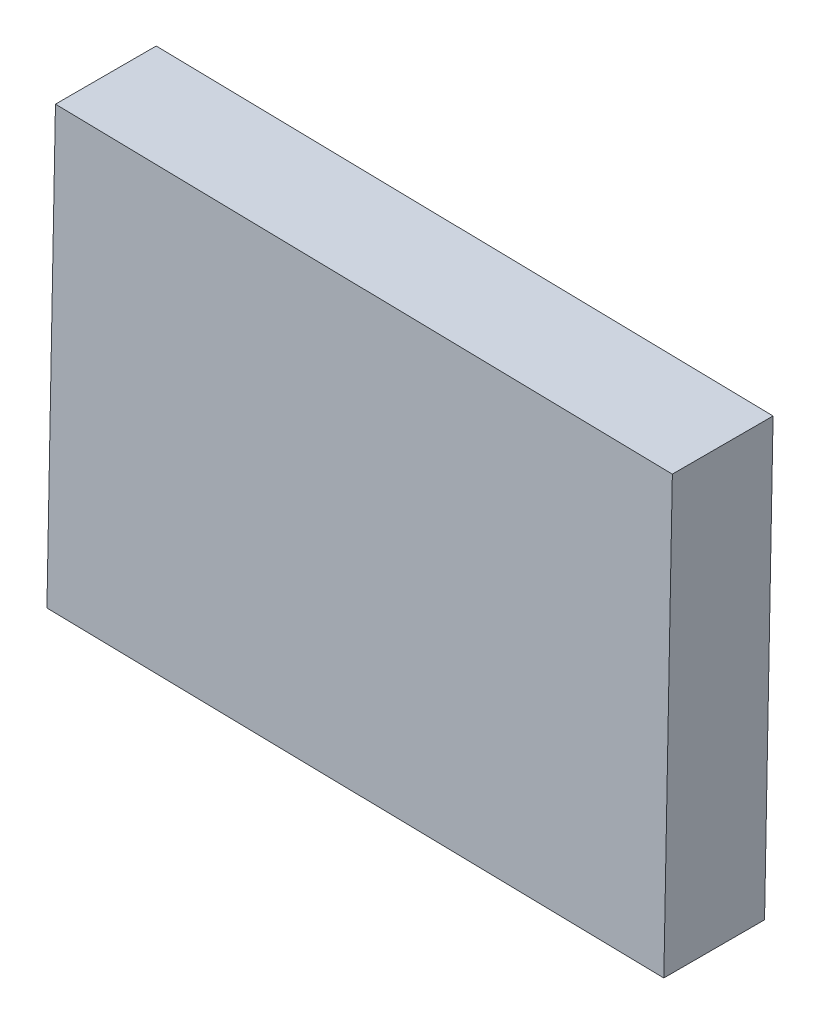
ISO-10303-21;
HEADER;
FILE_DESCRIPTION(('STEP AP214'),'2;1');
FILE_NAME('part.step','',(''),(''),'','','');
FILE_SCHEMA(('AUTOMOTIVE_DESIGN { 1 0 10303 214 1 1 1 1 }'));
ENDSEC;
DATA;
#1=APPLICATION_CONTEXT('core data for automotive mechanical design processes');
#2=APPLICATION_PROTOCOL_DEFINITION('international standard','automotive_design',2000,#1);
#3=PRODUCT_CONTEXT('',#1,'mechanical');
#4=PRODUCT('Part','Part','',(#3));
#5=PRODUCT_RELATED_PRODUCT_CATEGORY('part','',(#4));
#6=PRODUCT_DEFINITION_FORMATION('','',#4);
#7=PRODUCT_DEFINITION_CONTEXT('part definition',#1,'design');
#8=PRODUCT_DEFINITION('design','',#6,#7);
#9=PRODUCT_DEFINITION_SHAPE('','',#8);
#10=(LENGTH_UNIT() NAMED_UNIT(*) SI_UNIT(.MILLI.,.METRE.));
#11=(NAMED_UNIT(*) PLANE_ANGLE_UNIT() SI_UNIT($,.RADIAN.));
#12=(NAMED_UNIT(*) SI_UNIT($,.STERADIAN.) SOLID_ANGLE_UNIT());
#13=UNCERTAINTY_MEASURE_WITH_UNIT(LENGTH_MEASURE(1.E-05),#10,'distance_accuracy_value','');
#14=(GEOMETRIC_REPRESENTATION_CONTEXT(3) GLOBAL_UNCERTAINTY_ASSIGNED_CONTEXT((#13)) GLOBAL_UNIT_ASSIGNED_CONTEXT((#10,
#11,#12)) REPRESENTATION_CONTEXT('',''));
#15=CARTESIAN_POINT('',(0.,0.,0.));
#16=DIRECTION('',(0.,0.,1.));
#17=DIRECTION('',(1.,0.,0.));
#18=AXIS2_PLACEMENT_3D('',#15,#16,#17);
#19=CARTESIAN_POINT('',(-1.71669371262008,0.557184606220066,38.2500965279299));
#20=DIRECTION('',(0.,0.,-1.));
#21=DIRECTION('',(-0.0193548335692301,-0.999812677663925,0.));
#22=AXIS2_PLACEMENT_3D('',#19,#20,#21);
#23=PLANE('',#22);
#24=DIRECTION('',(-0.0193548335692301,-0.999812677663925,0.));
#25=VECTOR('',#24,1.);
#26=CARTESIAN_POINT('',(4.59117281569775,4.88090682913489,38.25009652793));
#27=LINE('',#26,#25);
#28=CARTESIAN_POINT('',(4.59117281569775,4.88090682913489,38.25009652793));
#29=VERTEX_POINT('',#28);
#30=CARTESIAN_POINT('',(4.4191083452673,-4.0074278752974,38.2500965279301));
#31=VERTEX_POINT('',#30);
#32=EDGE_CURVE('E59',#29,#31,#27,.T.);
#33=ORIENTED_EDGE('',*,*,#32,.T.);
#34=DIRECTION('',(-0.999812677663925,0.0193548335692301,0.));
#35=VECTOR('',#34,1.);
#36=CARTESIAN_POINT('',(4.4191083452673,-4.0074278752974,38.2500965279301));
#37=LINE('',#36,#35);
#38=CARTESIAN_POINT('',(-8.02456024093791,-3.76653761669476,38.2500965279297));
#39=VERTEX_POINT('',#38);
#40=EDGE_CURVE('E20',#31,#39,#37,.T.);
#41=ORIENTED_EDGE('',*,*,#40,.T.);
#42=DIRECTION('',(0.0193548335692301,0.999812677663925,0.));
#43=VECTOR('',#42,1.);
#44=CARTESIAN_POINT('',(-7.85249577050745,5.12179708773753,38.2500965279296));
#45=LINE('',#44,#43);
#46=CARTESIAN_POINT('',(-7.85249577050745,5.12179708773753,38.2500965279296));
#47=VERTEX_POINT('',#46);
#48=EDGE_CURVE('E56',#39,#47,#45,.T.);
#49=ORIENTED_EDGE('',*,*,#48,.T.);
#50=DIRECTION('',(0.999812677663925,-0.0193548335692301,0.));
#51=VECTOR('',#50,1.);
#52=CARTESIAN_POINT('',(4.59117281569775,4.88090682913489,38.25009652793));
#53=LINE('',#52,#51);
#54=EDGE_CURVE('E82',#47,#29,#53,.T.);
#55=ORIENTED_EDGE('',*,*,#54,.T.);
#56=EDGE_LOOP('',(#33,#41,#49,#55));
#57=FACE_BOUND('',#56,.T.);
#58=ADVANCED_FACE('F17',(#57),#23,.T.);
#59=CARTESIAN_POINT('',(4.41910834526723,-4.00742787529737,40.2820965279302));
#60=DIRECTION('',(0.0193548335692301,0.999812677663925,0.));
#61=DIRECTION('',(-0.999812677663925,0.0193548335692301,0.));
#62=AXIS2_PLACEMENT_3D('',#59,#60,#61);
#63=PLANE('',#62);
#64=DIRECTION('',(0.,0.,1.));
#65=VECTOR('',#64,1.);
#66=CARTESIAN_POINT('',(-8.02456024093798,-3.76653761669474,40.2820965279298));
#67=LINE('',#66,#65);
#68=CARTESIAN_POINT('',(-8.02456024093798,-3.76653761669474,40.2820965279298));
#69=VERTEX_POINT('',#68);
#70=EDGE_CURVE('E65',#69,#39,#67,.F.);
#71=ORIENTED_EDGE('',*,*,#70,.T.);
#72=ORIENTED_EDGE('',*,*,#40,.F.);
#73=DIRECTION('',(0.,0.,1.));
#74=VECTOR('',#73,1.);
#75=CARTESIAN_POINT('',(4.41910834526723,-4.00742787529737,40.2820965279302));
#76=LINE('',#75,#74);
#77=CARTESIAN_POINT('',(4.41910834526723,-4.00742787529737,40.2820965279302));
#78=VERTEX_POINT('',#77);
#79=EDGE_CURVE('E89',#31,#78,#76,.T.);
#80=ORIENTED_EDGE('',*,*,#79,.T.);
#81=DIRECTION('',(-0.999812677663925,0.0193548335692301,0.));
#82=VECTOR('',#81,1.);
#83=CARTESIAN_POINT('',(-1.80272594783537,-3.88698274599605,40.28209652793));
#84=LINE('',#83,#82);
#85=EDGE_CURVE('E76',#78,#69,#84,.T.);
#86=ORIENTED_EDGE('',*,*,#85,.T.);
#87=EDGE_LOOP('',(#71,#72,#80,#86));
#88=FACE_BOUND('',#87,.T.);
#89=ADVANCED_FACE('F75',(#88),#63,.F.);
#90=CARTESIAN_POINT('',(-7.85249577050752,5.12179708773756,40.2820965279296));
#91=DIRECTION('',(0.999812677663925,-0.0193548335692301,0.));
#92=DIRECTION('',(0.0193548335692301,0.999812677663925,0.));
#93=AXIS2_PLACEMENT_3D('',#90,#91,#92);
#94=PLANE('',#93);
#95=DIRECTION('',(0.,0.,1.));
#96=VECTOR('',#95,1.);
#97=CARTESIAN_POINT('',(-7.85249577050752,5.12179708773756,40.2820965279296));
#98=LINE('',#97,#96);
#99=CARTESIAN_POINT('',(-7.85249577050752,5.12179708773756,40.2820965279296));
#100=VERTEX_POINT('',#99);
#101=EDGE_CURVE('E71',#100,#47,#98,.F.);
#102=ORIENTED_EDGE('',*,*,#101,.T.);
#103=ORIENTED_EDGE('',*,*,#48,.F.);
#104=ORIENTED_EDGE('',*,*,#70,.F.);
#105=DIRECTION('',(-0.0193548335692301,-0.999812677663925,0.));
#106=VECTOR('',#105,1.);
#107=CARTESIAN_POINT('',(-7.93852800572275,0.677629735521414,40.2820965279297));
#108=LINE('',#107,#106);
#109=EDGE_CURVE('E94',#69,#100,#108,.F.);
#110=ORIENTED_EDGE('',*,*,#109,.T.);
#111=EDGE_LOOP('',(#102,#103,#104,#110));
#112=FACE_BOUND('',#111,.T.);
#113=ADVANCED_FACE('F68',(#112),#94,.F.);
#114=CARTESIAN_POINT('',(4.59117281569769,4.88090682913492,40.28209652793));
#115=DIRECTION('',(-0.0193548335692301,-0.999812677663925,0.));
#116=DIRECTION('',(0.999812677663925,-0.0193548335692301,0.));
#117=AXIS2_PLACEMENT_3D('',#114,#115,#116);
#118=PLANE('',#117);
#119=DIRECTION('',(0.,0.,1.));
#120=VECTOR('',#119,1.);
#121=CARTESIAN_POINT('',(4.59117281569769,4.88090682913492,40.28209652793));
#122=LINE('',#121,#120);
#123=CARTESIAN_POINT('',(4.59117281569769,4.88090682913492,40.28209652793));
#124=VERTEX_POINT('',#123);
#125=EDGE_CURVE('E35',#124,#29,#122,.F.);
#126=ORIENTED_EDGE('',*,*,#125,.T.);
#127=ORIENTED_EDGE('',*,*,#54,.F.);
#128=ORIENTED_EDGE('',*,*,#101,.F.);
#129=DIRECTION('',(-0.999812677663925,0.0193548335692301,0.));
#130=VECTOR('',#129,1.);
#131=CARTESIAN_POINT('',(-1.63066147740492,5.00135195843624,40.2820965279298));
#132=LINE('',#131,#130);
#133=EDGE_CURVE('E27',#100,#124,#132,.F.);
#134=ORIENTED_EDGE('',*,*,#133,.T.);
#135=EDGE_LOOP('',(#126,#127,#128,#134));
#136=FACE_BOUND('',#135,.T.);
#137=ADVANCED_FACE('F101',(#136),#118,.F.);
#138=CARTESIAN_POINT('',(4.59117281569769,4.88090682913492,40.28209652793));
#139=DIRECTION('',(-0.999812677663925,0.0193548335692301,0.));
#140=DIRECTION('',(-0.0193548335692301,-0.999812677663925,0.));
#141=AXIS2_PLACEMENT_3D('',#138,#139,#140);
#142=PLANE('',#141);
#143=ORIENTED_EDGE('',*,*,#79,.F.);
#144=ORIENTED_EDGE('',*,*,#32,.F.);
#145=ORIENTED_EDGE('',*,*,#125,.F.);
#146=DIRECTION('',(-0.0193548335692301,-0.999812677663925,0.));
#147=VECTOR('',#146,1.);
#148=CARTESIAN_POINT('',(4.50514058048246,0.436739476918776,40.2820965279301));
#149=LINE('',#148,#147);
#150=EDGE_CURVE('E11',#124,#78,#149,.T.);
#151=ORIENTED_EDGE('',*,*,#150,.T.);
#152=EDGE_LOOP('',(#143,#144,#145,#151));
#153=FACE_BOUND('',#152,.T.);
#154=ADVANCED_FACE('F104',(#153),#142,.F.);
#155=CARTESIAN_POINT('',(-1.71669371262014,0.557184606220095,40.2820965279299));
#156=DIRECTION('',(0.,0.,-1.));
#157=DIRECTION('',(-0.0193548335692301,-0.999812677663925,0.));
#158=AXIS2_PLACEMENT_3D('',#155,#156,#157);
#159=PLANE('',#158);
#160=ORIENTED_EDGE('',*,*,#133,.F.);
#161=ORIENTED_EDGE('',*,*,#109,.F.);
#162=ORIENTED_EDGE('',*,*,#85,.F.);
#163=ORIENTED_EDGE('',*,*,#150,.F.);
#164=EDGE_LOOP('',(#160,#161,#162,#163));
#165=FACE_BOUND('',#164,.T.);
#166=ADVANCED_FACE('F103',(#165),#159,.F.);
#167=CLOSED_SHELL('',(#58,#89,#113,#137,#154,#166));
#168=MANIFOLD_SOLID_BREP('B1',#167);
#169=ADVANCED_BREP_SHAPE_REPRESENTATION('',(#18,#168),#14);
#170=SHAPE_DEFINITION_REPRESENTATION(#9,#169);
ENDSEC;
END-ISO-10303-21;
